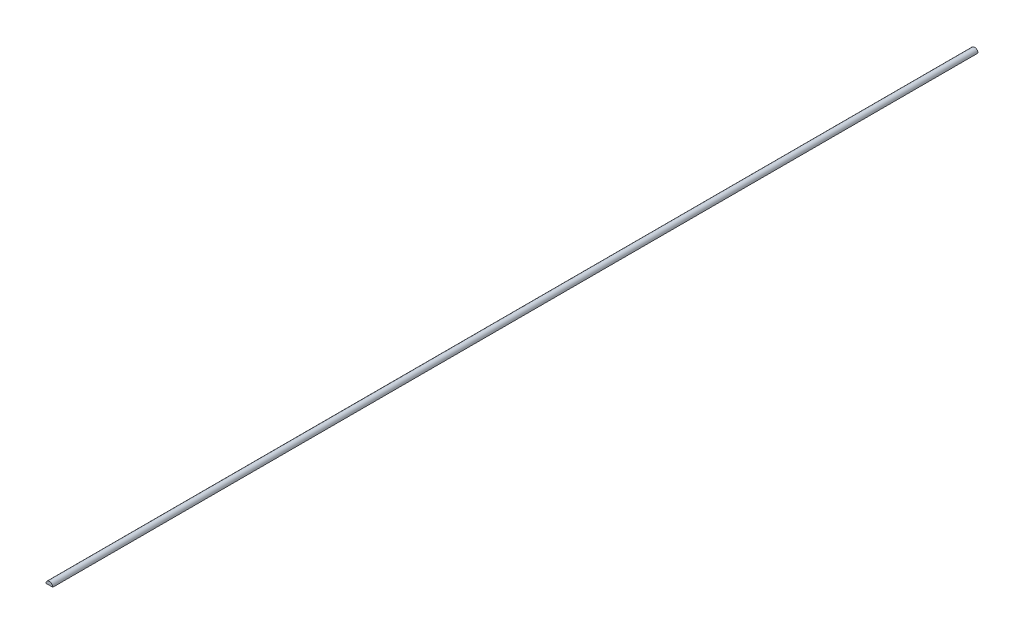
ISO-10303-21;
HEADER;
FILE_DESCRIPTION(('STEP AP214'),'2;1');
FILE_NAME('part.step','',(''),(''),'','','');
FILE_SCHEMA(('AUTOMOTIVE_DESIGN { 1 0 10303 214 1 1 1 1 }'));
ENDSEC;
DATA;
#1=APPLICATION_CONTEXT('core data for automotive mechanical design processes');
#2=APPLICATION_PROTOCOL_DEFINITION('international standard','automotive_design',2000,#1);
#3=PRODUCT_CONTEXT('',#1,'mechanical');
#4=PRODUCT('Part','Part','',(#3));
#5=PRODUCT_RELATED_PRODUCT_CATEGORY('part','',(#4));
#6=PRODUCT_DEFINITION_FORMATION('','',#4);
#7=PRODUCT_DEFINITION_CONTEXT('part definition',#1,'design');
#8=PRODUCT_DEFINITION('design','',#6,#7);
#9=PRODUCT_DEFINITION_SHAPE('','',#8);
#10=(LENGTH_UNIT() NAMED_UNIT(*) SI_UNIT(.MILLI.,.METRE.));
#11=(NAMED_UNIT(*) PLANE_ANGLE_UNIT() SI_UNIT($,.RADIAN.));
#12=(NAMED_UNIT(*) SI_UNIT($,.STERADIAN.) SOLID_ANGLE_UNIT());
#13=UNCERTAINTY_MEASURE_WITH_UNIT(LENGTH_MEASURE(1.E-05),#10,'distance_accuracy_value','');
#14=(GEOMETRIC_REPRESENTATION_CONTEXT(3) GLOBAL_UNCERTAINTY_ASSIGNED_CONTEXT((#13)) GLOBAL_UNIT_ASSIGNED_CONTEXT((#10,
#11,#12)) REPRESENTATION_CONTEXT('',''));
#15=CARTESIAN_POINT('',(0.,0.,0.));
#16=DIRECTION('',(0.,0.,1.));
#17=DIRECTION('',(1.,0.,0.));
#18=AXIS2_PLACEMENT_3D('',#15,#16,#17);
#19=CARTESIAN_POINT('',(0.,0.,101.95));
#20=DIRECTION('',(0.,0.,-1.));
#21=DIRECTION('',(-1.,0.,0.));
#22=AXIS2_PLACEMENT_3D('',#19,#20,#21);
#23=CYLINDRICAL_SURFACE('',#22,0.75);
#24=CARTESIAN_POINT('',(0.,0.,-101.95));
#25=DIRECTION('',(0.,0.,1.));
#26=DIRECTION('',(1.,0.,0.));
#27=AXIS2_PLACEMENT_3D('',#24,#25,#26);
#28=CIRCLE('',#27,0.75);
#29=CARTESIAN_POINT('',(0.75,0.,-101.95));
#30=VERTEX_POINT('',#29);
#31=CARTESIAN_POINT('',(-0.75,0.,-101.95));
#32=VERTEX_POINT('',#31);
#33=EDGE_CURVE('E64',#30,#32,#28,.T.);
#34=ORIENTED_EDGE('',*,*,#33,.T.);
#35=DIRECTION('',(0.,0.,-1.));
#36=VECTOR('',#35,1.);
#37=CARTESIAN_POINT('',(-0.75,0.,101.95));
#38=LINE('',#37,#36);
#39=CARTESIAN_POINT('',(-0.75,0.,101.95));
#40=VERTEX_POINT('',#39);
#41=EDGE_CURVE('E11',#40,#32,#38,.T.);
#42=ORIENTED_EDGE('',*,*,#41,.F.);
#43=CARTESIAN_POINT('',(0.,0.,101.95));
#44=DIRECTION('',(0.,0.,1.));
#45=DIRECTION('',(1.,0.,0.));
#46=AXIS2_PLACEMENT_3D('',#43,#44,#45);
#47=CIRCLE('',#46,0.75);
#48=CARTESIAN_POINT('',(0.75,0.,101.95));
#49=VERTEX_POINT('',#48);
#50=EDGE_CURVE('E63',#49,#40,#47,.T.);
#51=ORIENTED_EDGE('',*,*,#50,.F.);
#52=DIRECTION('',(0.,0.,-1.));
#53=VECTOR('',#52,1.);
#54=CARTESIAN_POINT('',(0.75,0.,101.95));
#55=LINE('',#54,#53);
#56=EDGE_CURVE('E41',#49,#30,#55,.T.);
#57=ORIENTED_EDGE('',*,*,#56,.T.);
#58=EDGE_LOOP('',(#34,#42,#51,#57));
#59=FACE_BOUND('',#58,.T.);
#60=ADVANCED_FACE('F33',(#59),#23,.T.);
#61=CARTESIAN_POINT('',(-0.75,0.,101.95));
#62=DIRECTION('',(0.,1.,0.));
#63=DIRECTION('',(0.,0.,1.));
#64=AXIS2_PLACEMENT_3D('',#61,#62,#63);
#65=PLANE('',#64);
#66=DIRECTION('',(1.,0.,0.));
#67=VECTOR('',#66,1.);
#68=CARTESIAN_POINT('',(-0.75,0.,-101.95));
#69=LINE('',#68,#67);
#70=EDGE_CURVE('E56',#32,#30,#69,.T.);
#71=ORIENTED_EDGE('',*,*,#70,.T.);
#72=ORIENTED_EDGE('',*,*,#56,.F.);
#73=DIRECTION('',(1.,0.,0.));
#74=VECTOR('',#73,1.);
#75=CARTESIAN_POINT('',(-0.75,0.,101.95));
#76=LINE('',#75,#74);
#77=EDGE_CURVE('E48',#40,#49,#76,.T.);
#78=ORIENTED_EDGE('',*,*,#77,.F.);
#79=ORIENTED_EDGE('',*,*,#41,.T.);
#80=EDGE_LOOP('',(#71,#72,#78,#79));
#81=FACE_BOUND('',#80,.T.);
#82=ADVANCED_FACE('F59',(#81),#65,.F.);
#83=CARTESIAN_POINT('',(0.,0.,101.95));
#84=DIRECTION('',(0.,0.,1.));
#85=DIRECTION('',(1.,0.,0.));
#86=AXIS2_PLACEMENT_3D('',#83,#84,#85);
#87=PLANE('',#86);
#88=ORIENTED_EDGE('',*,*,#50,.T.);
#89=ORIENTED_EDGE('',*,*,#77,.T.);
#90=EDGE_LOOP('',(#88,#89));
#91=FACE_BOUND('',#90,.T.);
#92=ADVANCED_FACE('F71',(#91),#87,.T.);
#93=CARTESIAN_POINT('',(0.,0.,-101.95));
#94=DIRECTION('',(0.,0.,1.));
#95=DIRECTION('',(1.,0.,0.));
#96=AXIS2_PLACEMENT_3D('',#93,#94,#95);
#97=PLANE('',#96);
#98=ORIENTED_EDGE('',*,*,#33,.F.);
#99=ORIENTED_EDGE('',*,*,#70,.F.);
#100=EDGE_LOOP('',(#98,#99));
#101=FACE_BOUND('',#100,.T.);
#102=ADVANCED_FACE('F67',(#101),#97,.F.);
#103=CLOSED_SHELL('',(#60,#82,#92,#102));
#104=MANIFOLD_SOLID_BREP('B2',#103);
#105=ADVANCED_BREP_SHAPE_REPRESENTATION('',(#18,#104),#14);
#106=SHAPE_DEFINITION_REPRESENTATION(#9,#105);
ENDSEC;
END-ISO-10303-21;
